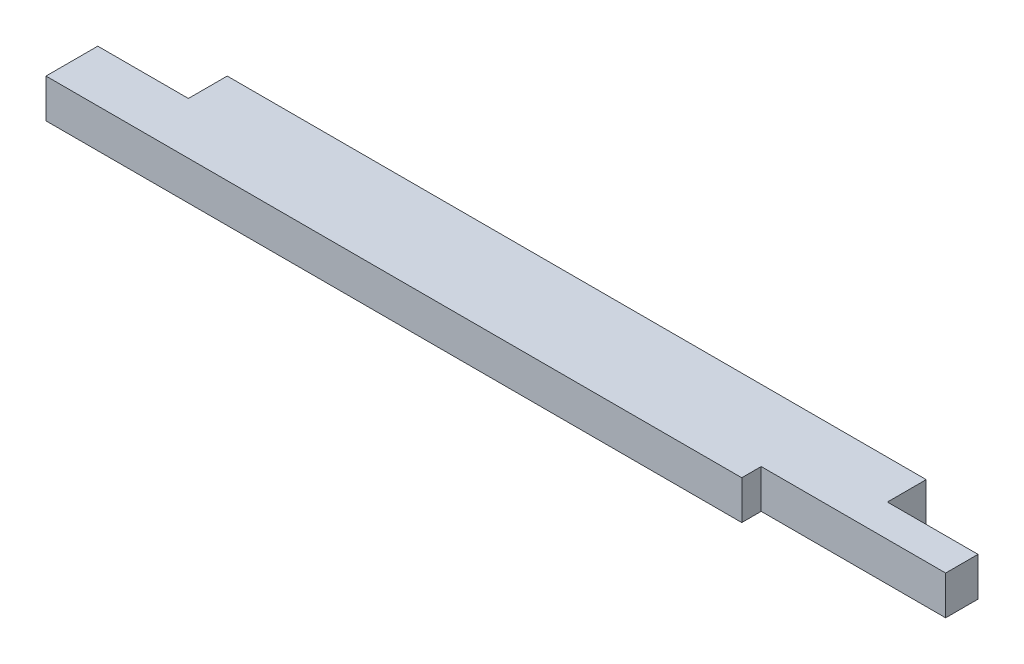
ISO-10303-21;
HEADER;
FILE_DESCRIPTION(('STEP AP214'),'2;1');
FILE_NAME('part.step','',(''),(''),'','','');
FILE_SCHEMA(('AUTOMOTIVE_DESIGN { 1 0 10303 214 1 1 1 1 }'));
ENDSEC;
DATA;
#1=APPLICATION_CONTEXT('core data for automotive mechanical design processes');
#2=APPLICATION_PROTOCOL_DEFINITION('international standard','automotive_design',2000,#1);
#3=PRODUCT_CONTEXT('',#1,'mechanical');
#4=PRODUCT('Part','Part','',(#3));
#5=PRODUCT_RELATED_PRODUCT_CATEGORY('part','',(#4));
#6=PRODUCT_DEFINITION_FORMATION('','',#4);
#7=PRODUCT_DEFINITION_CONTEXT('part definition',#1,'design');
#8=PRODUCT_DEFINITION('design','',#6,#7);
#9=PRODUCT_DEFINITION_SHAPE('','',#8);
#10=(LENGTH_UNIT() NAMED_UNIT(*) SI_UNIT(.MILLI.,.METRE.));
#11=(NAMED_UNIT(*) PLANE_ANGLE_UNIT() SI_UNIT($,.RADIAN.));
#12=(NAMED_UNIT(*) SI_UNIT($,.STERADIAN.) SOLID_ANGLE_UNIT());
#13=UNCERTAINTY_MEASURE_WITH_UNIT(LENGTH_MEASURE(1.E-05),#10,'distance_accuracy_value','');
#14=(GEOMETRIC_REPRESENTATION_CONTEXT(3) GLOBAL_UNCERTAINTY_ASSIGNED_CONTEXT((#13)) GLOBAL_UNIT_ASSIGNED_CONTEXT((#10,
#11,#12)) REPRESENTATION_CONTEXT('',''));
#15=CARTESIAN_POINT('',(0.,0.,0.));
#16=DIRECTION('',(0.,0.,1.));
#17=DIRECTION('',(1.,0.,0.));
#18=AXIS2_PLACEMENT_3D('',#15,#16,#17);
#19=CARTESIAN_POINT('',(0.,38.1,0.));
#20=DIRECTION('',(1.,0.,0.));
#21=DIRECTION('',(0.,0.,-1.));
#22=AXIS2_PLACEMENT_3D('',#19,#20,#21);
#23=PLANE('',#22);
#24=DIRECTION('',(0.,0.,1.));
#25=VECTOR('',#24,1.);
#26=CARTESIAN_POINT('',(0.,38.1,0.));
#27=LINE('',#26,#25);
#28=CARTESIAN_POINT('',(0.,38.1,-50.8));
#29=VERTEX_POINT('',#28);
#30=CARTESIAN_POINT('',(0.,38.1,0.));
#31=VERTEX_POINT('',#30);
#32=EDGE_CURVE('E140',#29,#31,#27,.T.);
#33=ORIENTED_EDGE('',*,*,#32,.F.);
#34=DIRECTION('',(0.,1.,0.));
#35=VECTOR('',#34,1.);
#36=CARTESIAN_POINT('',(0.,0.,-50.8));
#37=LINE('',#36,#35);
#38=CARTESIAN_POINT('',(0.,0.,-50.8));
#39=VERTEX_POINT('',#38);
#40=EDGE_CURVE('E171',#39,#29,#37,.T.);
#41=ORIENTED_EDGE('',*,*,#40,.F.);
#42=DIRECTION('',(0.,0.,1.));
#43=VECTOR('',#42,1.);
#44=CARTESIAN_POINT('',(0.,0.,0.));
#45=LINE('',#44,#43);
#46=CARTESIAN_POINT('',(0.,0.,0.));
#47=VERTEX_POINT('',#46);
#48=EDGE_CURVE('E142',#39,#47,#45,.T.);
#49=ORIENTED_EDGE('',*,*,#48,.T.);
#50=DIRECTION('',(0.,-1.,0.));
#51=VECTOR('',#50,1.);
#52=CARTESIAN_POINT('',(0.,38.1,0.));
#53=LINE('',#52,#51);
#54=EDGE_CURVE('E11',#31,#47,#53,.T.);
#55=ORIENTED_EDGE('',*,*,#54,.F.);
#56=EDGE_LOOP('',(#33,#41,#49,#55));
#57=FACE_BOUND('',#56,.T.);
#58=ADVANCED_FACE('F38',(#57),#23,.F.);
#59=CARTESIAN_POINT('',(0.,38.1,0.));
#60=DIRECTION('',(0.,0.,-1.));
#61=DIRECTION('',(-1.,0.,0.));
#62=AXIS2_PLACEMENT_3D('',#59,#60,#61);
#63=PLANE('',#62);
#64=DIRECTION('',(1.,0.,0.));
#65=VECTOR('',#64,1.);
#66=CARTESIAN_POINT('',(0.,0.,0.));
#67=LINE('',#66,#65);
#68=CARTESIAN_POINT('',(682.625,0.,0.));
#69=VERTEX_POINT('',#68);
#70=EDGE_CURVE('E137',#47,#69,#67,.T.);
#71=ORIENTED_EDGE('',*,*,#70,.T.);
#72=DIRECTION('',(0.,1.,0.));
#73=VECTOR('',#72,1.);
#74=CARTESIAN_POINT('',(682.625,0.,0.));
#75=LINE('',#74,#73);
#76=CARTESIAN_POINT('',(682.625,38.1,0.));
#77=VERTEX_POINT('',#76);
#78=EDGE_CURVE('E168',#69,#77,#75,.T.);
#79=ORIENTED_EDGE('',*,*,#78,.T.);
#80=DIRECTION('',(1.,0.,0.));
#81=VECTOR('',#80,1.);
#82=CARTESIAN_POINT('',(0.,38.1,0.));
#83=LINE('',#82,#81);
#84=EDGE_CURVE('E150',#31,#77,#83,.T.);
#85=ORIENTED_EDGE('',*,*,#84,.F.);
#86=ORIENTED_EDGE('',*,*,#54,.T.);
#87=EDGE_LOOP('',(#71,#79,#85,#86));
#88=FACE_BOUND('',#87,.T.);
#89=ADVANCED_FACE('F194',(#88),#63,.F.);
#90=CARTESIAN_POINT('',(863.6,38.1,0.));
#91=DIRECTION('',(-1.,0.,0.));
#92=DIRECTION('',(0.,0.,1.));
#93=AXIS2_PLACEMENT_3D('',#90,#91,#92);
#94=PLANE('',#93);
#95=DIRECTION('',(0.,0.,-1.));
#96=VECTOR('',#95,1.);
#97=CARTESIAN_POINT('',(863.6,38.1,0.));
#98=LINE('',#97,#96);
#99=CARTESIAN_POINT('',(863.6,38.1,-19.05));
#100=VERTEX_POINT('',#99);
#101=CARTESIAN_POINT('',(863.6,38.1,-50.8));
#102=VERTEX_POINT('',#101);
#103=EDGE_CURVE('E130',#100,#102,#98,.T.);
#104=ORIENTED_EDGE('',*,*,#103,.F.);
#105=DIRECTION('',(0.,1.,0.));
#106=VECTOR('',#105,1.);
#107=CARTESIAN_POINT('',(863.6,0.,-19.05));
#108=LINE('',#107,#106);
#109=CARTESIAN_POINT('',(863.6,0.,-19.05));
#110=VERTEX_POINT('',#109);
#111=EDGE_CURVE('E117',#110,#100,#108,.T.);
#112=ORIENTED_EDGE('',*,*,#111,.F.);
#113=DIRECTION('',(0.,0.,-1.));
#114=VECTOR('',#113,1.);
#115=CARTESIAN_POINT('',(863.6,0.,0.));
#116=LINE('',#115,#114);
#117=CARTESIAN_POINT('',(863.6,0.,-50.8));
#118=VERTEX_POINT('',#117);
#119=EDGE_CURVE('E128',#110,#118,#116,.T.);
#120=ORIENTED_EDGE('',*,*,#119,.T.);
#121=DIRECTION('',(0.,1.,0.));
#122=VECTOR('',#121,1.);
#123=CARTESIAN_POINT('',(863.6,0.,-50.8));
#124=LINE('',#123,#122);
#125=EDGE_CURVE('E165',#118,#102,#124,.T.);
#126=ORIENTED_EDGE('',*,*,#125,.T.);
#127=EDGE_LOOP('',(#104,#112,#120,#126));
#128=FACE_BOUND('',#127,.T.);
#129=ADVANCED_FACE('F126',(#128),#94,.F.);
#130=CARTESIAN_POINT('',(0.,38.1,-88.9));
#131=DIRECTION('',(0.,0.,1.));
#132=DIRECTION('',(1.,0.,0.));
#133=AXIS2_PLACEMENT_3D('',#130,#131,#132);
#134=PLANE('',#133);
#135=DIRECTION('',(-1.,0.,0.));
#136=VECTOR('',#135,1.);
#137=CARTESIAN_POINT('',(0.,0.,-88.9));
#138=LINE('',#137,#136);
#139=CARTESIAN_POINT('',(774.7,0.,-88.9));
#140=VERTEX_POINT('',#139);
#141=CARTESIAN_POINT('',(88.9,0.,-88.9));
#142=VERTEX_POINT('',#141);
#143=EDGE_CURVE('E136',#140,#142,#138,.T.);
#144=ORIENTED_EDGE('',*,*,#143,.T.);
#145=DIRECTION('',(0.,1.,0.));
#146=VECTOR('',#145,1.);
#147=CARTESIAN_POINT('',(88.9,0.,-88.9));
#148=LINE('',#147,#146);
#149=CARTESIAN_POINT('',(88.9,38.1,-88.9));
#150=VERTEX_POINT('',#149);
#151=EDGE_CURVE('E146',#142,#150,#148,.T.);
#152=ORIENTED_EDGE('',*,*,#151,.T.);
#153=DIRECTION('',(-1.,0.,0.));
#154=VECTOR('',#153,1.);
#155=CARTESIAN_POINT('',(0.,38.1,-88.9));
#156=LINE('',#155,#154);
#157=CARTESIAN_POINT('',(774.7,38.1,-88.9));
#158=VERTEX_POINT('',#157);
#159=EDGE_CURVE('E45',#158,#150,#156,.T.);
#160=ORIENTED_EDGE('',*,*,#159,.F.);
#161=DIRECTION('',(0.,1.,0.));
#162=VECTOR('',#161,1.);
#163=CARTESIAN_POINT('',(774.7,0.,-88.9));
#164=LINE('',#163,#162);
#165=EDGE_CURVE('E158',#140,#158,#164,.T.);
#166=ORIENTED_EDGE('',*,*,#165,.F.);
#167=EDGE_LOOP('',(#144,#152,#160,#166));
#168=FACE_BOUND('',#167,.T.);
#169=ADVANCED_FACE('F209',(#168),#134,.F.);
#170=CARTESIAN_POINT('',(0.,38.1,0.));
#171=DIRECTION('',(0.,-1.,0.));
#172=DIRECTION('',(0.,0.,-1.));
#173=AXIS2_PLACEMENT_3D('',#170,#171,#172);
#174=PLANE('',#173);
#175=ORIENTED_EDGE('',*,*,#84,.T.);
#176=DIRECTION('',(0.,0.,1.));
#177=VECTOR('',#176,1.);
#178=CARTESIAN_POINT('',(682.625,38.1,0.));
#179=LINE('',#178,#177);
#180=CARTESIAN_POINT('',(682.625,38.1,-19.05));
#181=VERTEX_POINT('',#180);
#182=EDGE_CURVE('E122',#181,#77,#179,.T.);
#183=ORIENTED_EDGE('',*,*,#182,.F.);
#184=DIRECTION('',(-1.,0.,0.));
#185=VECTOR('',#184,1.);
#186=CARTESIAN_POINT('',(863.6,38.1,-19.05));
#187=LINE('',#186,#185);
#188=EDGE_CURVE('E189',#100,#181,#187,.T.);
#189=ORIENTED_EDGE('',*,*,#188,.F.);
#190=ORIENTED_EDGE('',*,*,#103,.T.);
#191=DIRECTION('',(1.,0.,0.));
#192=VECTOR('',#191,1.);
#193=CARTESIAN_POINT('',(863.6,38.1,-50.8));
#194=LINE('',#193,#192);
#195=CARTESIAN_POINT('',(774.7,38.1,-50.8));
#196=VERTEX_POINT('',#195);
#197=EDGE_CURVE('E156',#196,#102,#194,.T.);
#198=ORIENTED_EDGE('',*,*,#197,.F.);
#199=DIRECTION('',(0.,0.,1.));
#200=VECTOR('',#199,1.);
#201=CARTESIAN_POINT('',(774.7,38.1,-88.9));
#202=LINE('',#201,#200);
#203=EDGE_CURVE('E159',#158,#196,#202,.T.);
#204=ORIENTED_EDGE('',*,*,#203,.F.);
#205=ORIENTED_EDGE('',*,*,#159,.T.);
#206=DIRECTION('',(0.,0.,-1.));
#207=VECTOR('',#206,1.);
#208=CARTESIAN_POINT('',(88.9,38.1,-88.9));
#209=LINE('',#208,#207);
#210=CARTESIAN_POINT('',(88.9,38.1,-50.8));
#211=VERTEX_POINT('',#210);
#212=EDGE_CURVE('E177',#211,#150,#209,.T.);
#213=ORIENTED_EDGE('',*,*,#212,.F.);
#214=DIRECTION('',(1.,0.,0.));
#215=VECTOR('',#214,1.);
#216=CARTESIAN_POINT('',(0.,38.1,-50.8));
#217=LINE('',#216,#215);
#218=EDGE_CURVE('E162',#29,#211,#217,.T.);
#219=ORIENTED_EDGE('',*,*,#218,.F.);
#220=ORIENTED_EDGE('',*,*,#32,.T.);
#221=EDGE_LOOP('',(#175,#183,#189,#190,#198,#204,#205,#213,#219,#220));
#222=FACE_BOUND('',#221,.T.);
#223=ADVANCED_FACE('F212',(#222),#174,.F.);
#224=CARTESIAN_POINT('',(0.,0.,0.));
#225=DIRECTION('',(0.,-1.,0.));
#226=DIRECTION('',(0.,0.,-1.));
#227=AXIS2_PLACEMENT_3D('',#224,#225,#226);
#228=PLANE('',#227);
#229=DIRECTION('',(0.,0.,1.));
#230=VECTOR('',#229,1.);
#231=CARTESIAN_POINT('',(682.625,0.,0.));
#232=LINE('',#231,#230);
#233=CARTESIAN_POINT('',(682.625,0.,-19.05));
#234=VERTEX_POINT('',#233);
#235=EDGE_CURVE('E52',#234,#69,#232,.T.);
#236=ORIENTED_EDGE('',*,*,#235,.T.);
#237=ORIENTED_EDGE('',*,*,#70,.F.);
#238=ORIENTED_EDGE('',*,*,#48,.F.);
#239=DIRECTION('',(1.,0.,0.));
#240=VECTOR('',#239,1.);
#241=CARTESIAN_POINT('',(0.,0.,-50.8));
#242=LINE('',#241,#240);
#243=CARTESIAN_POINT('',(88.9,0.,-50.8));
#244=VERTEX_POINT('',#243);
#245=EDGE_CURVE('E179',#39,#244,#242,.T.);
#246=ORIENTED_EDGE('',*,*,#245,.T.);
#247=DIRECTION('',(0.,0.,-1.));
#248=VECTOR('',#247,1.);
#249=CARTESIAN_POINT('',(88.9,0.,-88.9));
#250=LINE('',#249,#248);
#251=EDGE_CURVE('E60',#244,#142,#250,.T.);
#252=ORIENTED_EDGE('',*,*,#251,.T.);
#253=ORIENTED_EDGE('',*,*,#143,.F.);
#254=DIRECTION('',(0.,0.,1.));
#255=VECTOR('',#254,1.);
#256=CARTESIAN_POINT('',(774.7,0.,-88.9));
#257=LINE('',#256,#255);
#258=CARTESIAN_POINT('',(774.7,0.,-50.8));
#259=VERTEX_POINT('',#258);
#260=EDGE_CURVE('E154',#140,#259,#257,.T.);
#261=ORIENTED_EDGE('',*,*,#260,.T.);
#262=DIRECTION('',(1.,0.,0.));
#263=VECTOR('',#262,1.);
#264=CARTESIAN_POINT('',(863.6,0.,-50.8));
#265=LINE('',#264,#263);
#266=EDGE_CURVE('E135',#259,#118,#265,.T.);
#267=ORIENTED_EDGE('',*,*,#266,.T.);
#268=ORIENTED_EDGE('',*,*,#119,.F.);
#269=DIRECTION('',(-1.,0.,0.));
#270=VECTOR('',#269,1.);
#271=CARTESIAN_POINT('',(863.6,0.,-19.05));
#272=LINE('',#271,#270);
#273=EDGE_CURVE('E113',#110,#234,#272,.T.);
#274=ORIENTED_EDGE('',*,*,#273,.T.);
#275=EDGE_LOOP('',(#236,#237,#238,#246,#252,#253,#261,#267,#268,#274));
#276=FACE_BOUND('',#275,.T.);
#277=ADVANCED_FACE('F133',(#276),#228,.T.);
#278=CARTESIAN_POINT('',(863.6,0.,-50.8));
#279=DIRECTION('',(0.,0.,1.));
#280=DIRECTION('',(1.,0.,0.));
#281=AXIS2_PLACEMENT_3D('',#278,#279,#280);
#282=PLANE('',#281);
#283=ORIENTED_EDGE('',*,*,#197,.T.);
#284=ORIENTED_EDGE('',*,*,#125,.F.);
#285=ORIENTED_EDGE('',*,*,#266,.F.);
#286=DIRECTION('',(0.,1.,0.));
#287=VECTOR('',#286,1.);
#288=CARTESIAN_POINT('',(774.7,0.,-50.8));
#289=LINE('',#288,#287);
#290=EDGE_CURVE('E167',#259,#196,#289,.T.);
#291=ORIENTED_EDGE('',*,*,#290,.T.);
#292=EDGE_LOOP('',(#283,#284,#285,#291));
#293=FACE_BOUND('',#292,.T.);
#294=ADVANCED_FACE('F218',(#293),#282,.F.);
#295=CARTESIAN_POINT('',(774.7,0.,-88.9));
#296=DIRECTION('',(-1.,0.,0.));
#297=DIRECTION('',(0.,0.,1.));
#298=AXIS2_PLACEMENT_3D('',#295,#296,#297);
#299=PLANE('',#298);
#300=ORIENTED_EDGE('',*,*,#203,.T.);
#301=ORIENTED_EDGE('',*,*,#290,.F.);
#302=ORIENTED_EDGE('',*,*,#260,.F.);
#303=ORIENTED_EDGE('',*,*,#165,.T.);
#304=EDGE_LOOP('',(#300,#301,#302,#303));
#305=FACE_BOUND('',#304,.T.);
#306=ADVANCED_FACE('F216',(#305),#299,.F.);
#307=CARTESIAN_POINT('',(88.9,0.,-88.9));
#308=DIRECTION('',(1.,0.,0.));
#309=DIRECTION('',(0.,0.,-1.));
#310=AXIS2_PLACEMENT_3D('',#307,#308,#309);
#311=PLANE('',#310);
#312=ORIENTED_EDGE('',*,*,#212,.T.);
#313=ORIENTED_EDGE('',*,*,#151,.F.);
#314=ORIENTED_EDGE('',*,*,#251,.F.);
#315=DIRECTION('',(0.,1.,0.));
#316=VECTOR('',#315,1.);
#317=CARTESIAN_POINT('',(88.9,0.,-50.8));
#318=LINE('',#317,#316);
#319=EDGE_CURVE('E173',#244,#211,#318,.T.);
#320=ORIENTED_EDGE('',*,*,#319,.T.);
#321=EDGE_LOOP('',(#312,#313,#314,#320));
#322=FACE_BOUND('',#321,.T.);
#323=ADVANCED_FACE('F205',(#322),#311,.F.);
#324=CARTESIAN_POINT('',(0.,0.,-50.8));
#325=DIRECTION('',(0.,0.,1.));
#326=DIRECTION('',(1.,0.,0.));
#327=AXIS2_PLACEMENT_3D('',#324,#325,#326);
#328=PLANE('',#327);
#329=ORIENTED_EDGE('',*,*,#218,.T.);
#330=ORIENTED_EDGE('',*,*,#319,.F.);
#331=ORIENTED_EDGE('',*,*,#245,.F.);
#332=ORIENTED_EDGE('',*,*,#40,.T.);
#333=EDGE_LOOP('',(#329,#330,#331,#332));
#334=FACE_BOUND('',#333,.T.);
#335=ADVANCED_FACE('F202',(#334),#328,.F.);
#336=CARTESIAN_POINT('',(682.625,0.,0.));
#337=DIRECTION('',(-1.,0.,0.));
#338=DIRECTION('',(0.,0.,1.));
#339=AXIS2_PLACEMENT_3D('',#336,#337,#338);
#340=PLANE('',#339);
#341=ORIENTED_EDGE('',*,*,#182,.T.);
#342=ORIENTED_EDGE('',*,*,#78,.F.);
#343=ORIENTED_EDGE('',*,*,#235,.F.);
#344=DIRECTION('',(0.,1.,0.));
#345=VECTOR('',#344,1.);
#346=CARTESIAN_POINT('',(682.625,0.,-19.05));
#347=LINE('',#346,#345);
#348=EDGE_CURVE('E119',#234,#181,#347,.T.);
#349=ORIENTED_EDGE('',*,*,#348,.T.);
#350=EDGE_LOOP('',(#341,#342,#343,#349));
#351=FACE_BOUND('',#350,.T.);
#352=ADVANCED_FACE('F254',(#351),#340,.F.);
#353=CARTESIAN_POINT('',(863.6,0.,-19.05));
#354=DIRECTION('',(0.,0.,-1.));
#355=DIRECTION('',(-1.,0.,0.));
#356=AXIS2_PLACEMENT_3D('',#353,#354,#355);
#357=PLANE('',#356);
#358=ORIENTED_EDGE('',*,*,#188,.T.);
#359=ORIENTED_EDGE('',*,*,#348,.F.);
#360=ORIENTED_EDGE('',*,*,#273,.F.);
#361=ORIENTED_EDGE('',*,*,#111,.T.);
#362=EDGE_LOOP('',(#358,#359,#360,#361));
#363=FACE_BOUND('',#362,.T.);
#364=ADVANCED_FACE('F116',(#363),#357,.F.);
#365=CLOSED_SHELL('',(#58,#89,#129,#169,#223,#277,#294,#306,#323,#335,#352,#364));
#366=MANIFOLD_SOLID_BREP('B2',#365);
#367=ADVANCED_BREP_SHAPE_REPRESENTATION('',(#18,#366),#14);
#368=SHAPE_DEFINITION_REPRESENTATION(#9,#367);
ENDSEC;
END-ISO-10303-21;
